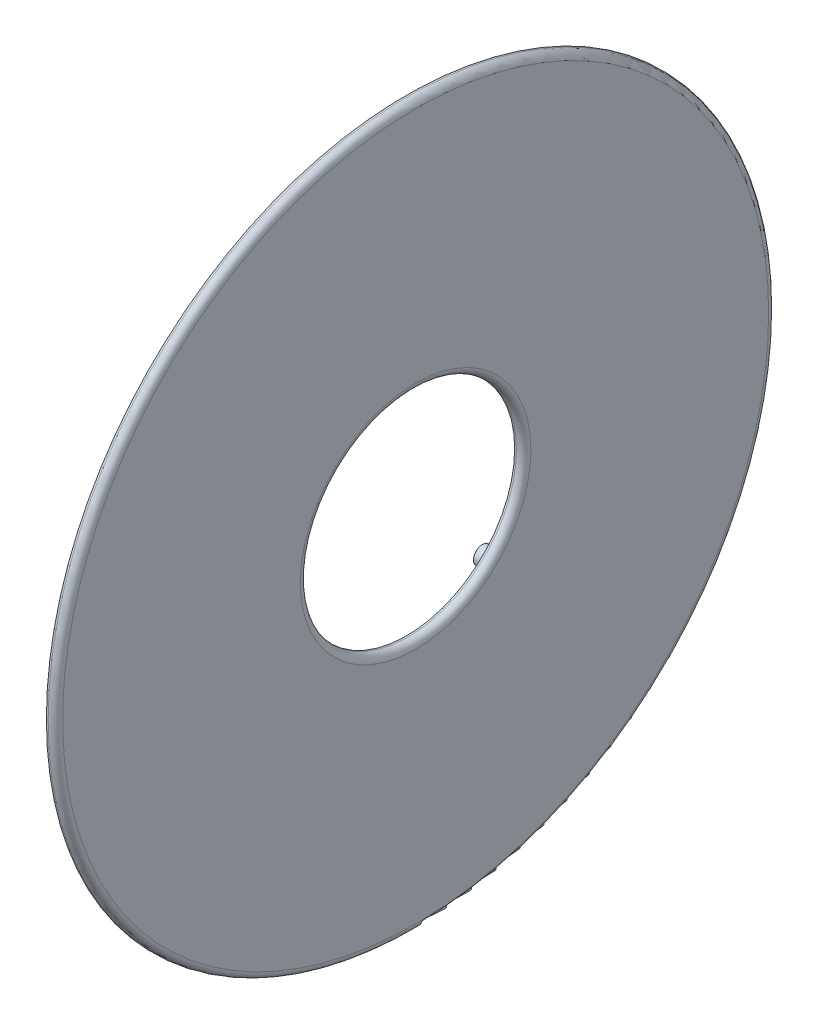
ISO-10303-21;
HEADER;
FILE_DESCRIPTION(('STEP AP214'),'2;1');
FILE_NAME('part.step','',(''),(''),'','','');
FILE_SCHEMA(('AUTOMOTIVE_DESIGN { 1 0 10303 214 1 1 1 1 }'));
ENDSEC;
DATA;
#1=APPLICATION_CONTEXT('core data for automotive mechanical design processes');
#2=APPLICATION_PROTOCOL_DEFINITION('international standard','automotive_design',2000,#1);
#3=PRODUCT_CONTEXT('',#1,'mechanical');
#4=PRODUCT('Part','Part','',(#3));
#5=PRODUCT_RELATED_PRODUCT_CATEGORY('part','',(#4));
#6=PRODUCT_DEFINITION_FORMATION('','',#4);
#7=PRODUCT_DEFINITION_CONTEXT('part definition',#1,'design');
#8=PRODUCT_DEFINITION('design','',#6,#7);
#9=PRODUCT_DEFINITION_SHAPE('','',#8);
#10=(LENGTH_UNIT() NAMED_UNIT(*) SI_UNIT(.MILLI.,.METRE.));
#11=(NAMED_UNIT(*) PLANE_ANGLE_UNIT() SI_UNIT($,.RADIAN.));
#12=(NAMED_UNIT(*) SI_UNIT($,.STERADIAN.) SOLID_ANGLE_UNIT());
#13=UNCERTAINTY_MEASURE_WITH_UNIT(LENGTH_MEASURE(1.E-05),#10,'distance_accuracy_value','');
#14=(GEOMETRIC_REPRESENTATION_CONTEXT(3) GLOBAL_UNCERTAINTY_ASSIGNED_CONTEXT((#13)) GLOBAL_UNIT_ASSIGNED_CONTEXT((#10,
#11,#12)) REPRESENTATION_CONTEXT('',''));
#15=CARTESIAN_POINT('',(0.,0.,0.));
#16=DIRECTION('',(0.,0.,1.));
#17=DIRECTION('',(1.,0.,0.));
#18=AXIS2_PLACEMENT_3D('',#15,#16,#17);
#19=CARTESIAN_POINT('',(0.,0.,0.));
#20=DIRECTION('',(1.,0.,0.));
#21=DIRECTION('',(0.,0.,-1.));
#22=AXIS2_PLACEMENT_3D('',#19,#20,#21);
#23=PLANE('',#22);
#24=CARTESIAN_POINT('',(0.,-7.63321770290865,7.63321770290874));
#25=DIRECTION('',(1.,0.,0.));
#26=DIRECTION('',(0.,0.,-1.));
#27=AXIS2_PLACEMENT_3D('',#24,#25,#26);
#28=CIRCLE('',#27,0.635000000000002);
#29=CARTESIAN_POINT('',(0.,-7.63321770290865,6.99821770290874));
#30=VERTEX_POINT('',#29);
#31=EDGE_CURVE('E40',#30,#30,#28,.F.);
#32=ORIENTED_EDGE('',*,*,#31,.F.);
#33=EDGE_LOOP('',(#32));
#34=FACE_BOUND('',#33,.T.);
#35=CARTESIAN_POINT('',(0.,7.63321770290882,-7.63321770290874));
#36=DIRECTION('',(1.,0.,0.));
#37=DIRECTION('',(0.,0.,-1.));
#38=AXIS2_PLACEMENT_3D('',#35,#36,#37);
#39=CIRCLE('',#38,0.634999999999951);
#40=CARTESIAN_POINT('',(0.,7.63321770290882,-8.26821770290869));
#41=VERTEX_POINT('',#40);
#42=EDGE_CURVE('E48',#41,#41,#39,.F.);
#43=ORIENTED_EDGE('',*,*,#42,.F.);
#44=EDGE_LOOP('',(#43));
#45=FACE_BOUND('',#44,.T.);
#46=CARTESIAN_POINT('',(0.,0.,0.));
#47=DIRECTION('',(1.,0.,0.));
#48=DIRECTION('',(0.,0.,-1.));
#49=AXIS2_PLACEMENT_3D('',#46,#47,#48);
#50=CIRCLE('',#49,25.4);
#51=CARTESIAN_POINT('',(0.,0.,-25.4));
#52=VERTEX_POINT('',#51);
#53=EDGE_CURVE('E65',#52,#52,#50,.T.);
#54=ORIENTED_EDGE('',*,*,#53,.F.);
#55=EDGE_LOOP('',(#54));
#56=FACE_BOUND('',#55,.T.);
#57=CARTESIAN_POINT('',(0.,0.,0.));
#58=DIRECTION('',(1.,0.,0.));
#59=DIRECTION('',(0.,0.,-1.));
#60=AXIS2_PLACEMENT_3D('',#57,#58,#59);
#61=CIRCLE('',#60,7.62);
#62=CARTESIAN_POINT('',(0.,0.,-7.62));
#63=VERTEX_POINT('',#62);
#64=EDGE_CURVE('E68',#63,#63,#61,.T.);
#65=ORIENTED_EDGE('',*,*,#64,.T.);
#66=EDGE_LOOP('',(#65));
#67=FACE_BOUND('',#66,.T.);
#68=CARTESIAN_POINT('',(0.,7.63321770290882,7.63321770290874));
#69=DIRECTION('',(1.,0.,0.));
#70=DIRECTION('',(0.,0.,-1.));
#71=AXIS2_PLACEMENT_3D('',#68,#69,#70);
#72=CIRCLE('',#71,0.635000000000001);
#73=CARTESIAN_POINT('',(0.,7.63321770290882,6.99821770290874));
#74=VERTEX_POINT('',#73);
#75=EDGE_CURVE('E44',#74,#74,#72,.F.);
#76=ORIENTED_EDGE('',*,*,#75,.F.);
#77=EDGE_LOOP('',(#76));
#78=FACE_BOUND('',#77,.T.);
#79=CARTESIAN_POINT('',(0.,-7.63321770290865,-7.63321770290874));
#80=DIRECTION('',(1.,0.,0.));
#81=DIRECTION('',(0.,0.,-1.));
#82=AXIS2_PLACEMENT_3D('',#79,#80,#81);
#83=CIRCLE('',#82,0.635000000000001);
#84=CARTESIAN_POINT('',(0.,-7.63321770290865,-8.26821770290874));
#85=VERTEX_POINT('',#84);
#86=EDGE_CURVE('E10',#85,#85,#83,.F.);
#87=ORIENTED_EDGE('',*,*,#86,.F.);
#88=EDGE_LOOP('',(#87));
#89=FACE_BOUND('',#88,.T.);
#90=ADVANCED_FACE('F33',(#34,#45,#56,#67,#78,#89),#23,.F.);
#91=CARTESIAN_POINT('',(0.635,0.,0.));
#92=DIRECTION('',(1.,0.,0.));
#93=DIRECTION('',(0.,0.,-1.));
#94=AXIS2_PLACEMENT_3D('',#91,#92,#93);
#95=PLANE('',#94);
#96=CARTESIAN_POINT('',(0.635,0.,0.));
#97=DIRECTION('',(1.,0.,0.));
#98=DIRECTION('',(0.,0.,-1.));
#99=AXIS2_PLACEMENT_3D('',#96,#97,#98);
#100=CIRCLE('',#99,8.128);
#101=CARTESIAN_POINT('',(0.635,0.,-8.128));
#102=VERTEX_POINT('',#101);
#103=EDGE_CURVE('E56',#102,#102,#100,.F.);
#104=ORIENTED_EDGE('',*,*,#103,.T.);
#105=EDGE_LOOP('',(#104));
#106=FACE_BOUND('',#105,.T.);
#107=CARTESIAN_POINT('',(0.635,0.,0.));
#108=DIRECTION('',(1.,0.,0.));
#109=DIRECTION('',(0.,0.,-1.));
#110=AXIS2_PLACEMENT_3D('',#107,#108,#109);
#111=CIRCLE('',#110,24.892);
#112=CARTESIAN_POINT('',(0.635,0.,-24.892));
#113=VERTEX_POINT('',#112);
#114=EDGE_CURVE('E59',#113,#113,#111,.T.);
#115=ORIENTED_EDGE('',*,*,#114,.T.);
#116=EDGE_LOOP('',(#115));
#117=FACE_BOUND('',#116,.T.);
#118=ADVANCED_FACE('F99',(#106,#117),#95,.T.);
#119=CARTESIAN_POINT('',(0.635,0.,0.));
#120=DIRECTION('',(-1.,0.,0.));
#121=DIRECTION('',(0.,0.,1.));
#122=AXIS2_PLACEMENT_3D('',#119,#120,#121);
#123=CYLINDRICAL_SURFACE('',#122,25.4);
#124=CARTESIAN_POINT('',(0.127,0.,0.));
#125=DIRECTION('',(1.,0.,0.));
#126=DIRECTION('',(0.,0.,-1.));
#127=AXIS2_PLACEMENT_3D('',#124,#125,#126);
#128=CIRCLE('',#127,25.4);
#129=CARTESIAN_POINT('',(0.127,0.,-25.4));
#130=VERTEX_POINT('',#129);
#131=EDGE_CURVE('E53',#130,#130,#128,.F.);
#132=ORIENTED_EDGE('',*,*,#131,.T.);
#133=EDGE_LOOP('',(#132));
#134=FACE_BOUND('',#133,.T.);
#135=ORIENTED_EDGE('',*,*,#53,.T.);
#136=EDGE_LOOP('',(#135));
#137=FACE_BOUND('',#136,.T.);
#138=ADVANCED_FACE('F105',(#134,#137),#123,.T.);
#139=CARTESIAN_POINT('',(0.635,0.,0.));
#140=DIRECTION('',(-1.,0.,0.));
#141=DIRECTION('',(0.,0.,1.));
#142=AXIS2_PLACEMENT_3D('',#139,#140,#141);
#143=CYLINDRICAL_SURFACE('',#142,7.62);
#144=CARTESIAN_POINT('',(0.127,0.,0.));
#145=DIRECTION('',(1.,0.,0.));
#146=DIRECTION('',(0.,0.,-1.));
#147=AXIS2_PLACEMENT_3D('',#144,#145,#146);
#148=CIRCLE('',#147,7.62);
#149=CARTESIAN_POINT('',(0.127,0.,-7.62));
#150=VERTEX_POINT('',#149);
#151=EDGE_CURVE('E62',#150,#150,#148,.T.);
#152=ORIENTED_EDGE('',*,*,#151,.T.);
#153=EDGE_LOOP('',(#152));
#154=FACE_BOUND('',#153,.T.);
#155=ORIENTED_EDGE('',*,*,#64,.F.);
#156=EDGE_LOOP('',(#155));
#157=FACE_BOUND('',#156,.T.);
#158=ADVANCED_FACE('F112',(#154,#157),#143,.F.);
#159=CARTESIAN_POINT('',(0.127,0.,0.));
#160=DIRECTION('',(1.,0.,0.));
#161=DIRECTION('',(0.,0.,-1.));
#162=AXIS2_PLACEMENT_3D('',#159,#160,#161);
#163=TOROIDAL_SURFACE('',#162,8.128,0.508);
#164=ORIENTED_EDGE('',*,*,#103,.F.);
#165=EDGE_LOOP('',(#164));
#166=FACE_BOUND('',#165,.T.);
#167=ORIENTED_EDGE('',*,*,#151,.F.);
#168=EDGE_LOOP('',(#167));
#169=FACE_BOUND('',#168,.T.);
#170=ADVANCED_FACE('F114',(#166,#169),#163,.T.);
#171=CARTESIAN_POINT('',(0.127,0.,0.));
#172=DIRECTION('',(1.,0.,0.));
#173=DIRECTION('',(0.,0.,-1.));
#174=AXIS2_PLACEMENT_3D('',#171,#172,#173);
#175=TOROIDAL_SURFACE('',#174,24.892,0.508);
#176=ORIENTED_EDGE('',*,*,#131,.F.);
#177=EDGE_LOOP('',(#176));
#178=FACE_BOUND('',#177,.T.);
#179=ORIENTED_EDGE('',*,*,#114,.F.);
#180=EDGE_LOOP('',(#179));
#181=FACE_BOUND('',#180,.T.);
#182=ADVANCED_FACE('F35',(#178,#181),#175,.T.);
#183=CARTESIAN_POINT('',(-2.286,7.63321770290882,-7.63321770290874));
#184=DIRECTION('',(1.,0.,0.));
#185=DIRECTION('',(0.,0.,-1.));
#186=AXIS2_PLACEMENT_3D('',#183,#184,#185);
#187=CYLINDRICAL_SURFACE('',#186,0.634999999999951);
#188=CARTESIAN_POINT('',(-2.286,7.63321770290882,-7.63321770290874));
#189=DIRECTION('',(-1.,0.,0.));
#190=DIRECTION('',(0.,0.,1.));
#191=AXIS2_PLACEMENT_3D('',#188,#189,#190);
#192=CIRCLE('',#191,0.634999999999951);
#193=CARTESIAN_POINT('',(-2.286,7.63321770290882,-6.99821770290879));
#194=VERTEX_POINT('',#193);
#195=EDGE_CURVE('E71',#194,#194,#192,.T.);
#196=ORIENTED_EDGE('',*,*,#195,.F.);
#197=EDGE_LOOP('',(#196));
#198=FACE_BOUND('',#197,.T.);
#199=ORIENTED_EDGE('',*,*,#42,.T.);
#200=EDGE_LOOP('',(#199));
#201=FACE_BOUND('',#200,.T.);
#202=ADVANCED_FACE('F121',(#198,#201),#187,.T.);
#203=CARTESIAN_POINT('',(-2.286,7.63321770290882,-7.63321770290874));
#204=DIRECTION('',(-1.,0.,0.));
#205=DIRECTION('',(0.,0.,1.));
#206=AXIS2_PLACEMENT_3D('',#203,#204,#205);
#207=PLANE('',#206);
#208=ORIENTED_EDGE('',*,*,#195,.T.);
#209=EDGE_LOOP('',(#208));
#210=FACE_BOUND('',#209,.T.);
#211=ADVANCED_FACE('F137',(#210),#207,.T.);
#212=CARTESIAN_POINT('',(-2.286,7.63321770290882,7.63321770290874));
#213=DIRECTION('',(1.,0.,0.));
#214=DIRECTION('',(0.,0.,-1.));
#215=AXIS2_PLACEMENT_3D('',#212,#213,#214);
#216=CYLINDRICAL_SURFACE('',#215,0.635000000000001);
#217=CARTESIAN_POINT('',(-2.286,7.63321770290882,7.63321770290874));
#218=DIRECTION('',(-1.,0.,0.));
#219=DIRECTION('',(0.,0.,1.));
#220=AXIS2_PLACEMENT_3D('',#217,#218,#219);
#221=CIRCLE('',#220,0.635000000000001);
#222=CARTESIAN_POINT('',(-2.286,7.63321770290882,8.26821770290874));
#223=VERTEX_POINT('',#222);
#224=EDGE_CURVE('E74',#223,#223,#221,.T.);
#225=ORIENTED_EDGE('',*,*,#224,.F.);
#226=EDGE_LOOP('',(#225));
#227=FACE_BOUND('',#226,.T.);
#228=ORIENTED_EDGE('',*,*,#75,.T.);
#229=EDGE_LOOP('',(#228));
#230=FACE_BOUND('',#229,.T.);
#231=ADVANCED_FACE('F134',(#227,#230),#216,.T.);
#232=CARTESIAN_POINT('',(-2.286,7.63321770290882,7.63321770290874));
#233=DIRECTION('',(-1.,0.,0.));
#234=DIRECTION('',(0.,0.,1.));
#235=AXIS2_PLACEMENT_3D('',#232,#233,#234);
#236=PLANE('',#235);
#237=ORIENTED_EDGE('',*,*,#224,.T.);
#238=EDGE_LOOP('',(#237));
#239=FACE_BOUND('',#238,.T.);
#240=ADVANCED_FACE('F136',(#239),#236,.T.);
#241=CARTESIAN_POINT('',(-2.286,-7.63321770290865,7.63321770290874));
#242=DIRECTION('',(1.,0.,0.));
#243=DIRECTION('',(0.,0.,-1.));
#244=AXIS2_PLACEMENT_3D('',#241,#242,#243);
#245=CYLINDRICAL_SURFACE('',#244,0.635000000000002);
#246=CARTESIAN_POINT('',(-2.286,-7.63321770290865,7.63321770290874));
#247=DIRECTION('',(-1.,0.,0.));
#248=DIRECTION('',(0.,0.,1.));
#249=AXIS2_PLACEMENT_3D('',#246,#247,#248);
#250=CIRCLE('',#249,0.635000000000002);
#251=CARTESIAN_POINT('',(-2.286,-7.63321770290865,8.26821770290874));
#252=VERTEX_POINT('',#251);
#253=EDGE_CURVE('E77',#252,#252,#250,.T.);
#254=ORIENTED_EDGE('',*,*,#253,.F.);
#255=EDGE_LOOP('',(#254));
#256=FACE_BOUND('',#255,.T.);
#257=ORIENTED_EDGE('',*,*,#31,.T.);
#258=EDGE_LOOP('',(#257));
#259=FACE_BOUND('',#258,.T.);
#260=ADVANCED_FACE('F95',(#256,#259),#245,.T.);
#261=CARTESIAN_POINT('',(-2.286,-7.63321770290865,7.63321770290874));
#262=DIRECTION('',(-1.,0.,0.));
#263=DIRECTION('',(0.,0.,1.));
#264=AXIS2_PLACEMENT_3D('',#261,#262,#263);
#265=PLANE('',#264);
#266=ORIENTED_EDGE('',*,*,#253,.T.);
#267=EDGE_LOOP('',(#266));
#268=FACE_BOUND('',#267,.T.);
#269=ADVANCED_FACE('F88',(#268),#265,.T.);
#270=CARTESIAN_POINT('',(-2.286,-7.63321770290865,-7.63321770290874));
#271=DIRECTION('',(1.,0.,0.));
#272=DIRECTION('',(0.,0.,-1.));
#273=AXIS2_PLACEMENT_3D('',#270,#271,#272);
#274=CYLINDRICAL_SURFACE('',#273,0.635000000000001);
#275=CARTESIAN_POINT('',(-2.286,-7.63321770290865,-7.63321770290874));
#276=DIRECTION('',(-1.,0.,0.));
#277=DIRECTION('',(0.,0.,1.));
#278=AXIS2_PLACEMENT_3D('',#275,#276,#277);
#279=CIRCLE('',#278,0.635000000000001);
#280=CARTESIAN_POINT('',(-2.286,-7.63321770290865,-6.99821770290874));
#281=VERTEX_POINT('',#280);
#282=EDGE_CURVE('E80',#281,#281,#279,.T.);
#283=ORIENTED_EDGE('',*,*,#282,.F.);
#284=EDGE_LOOP('',(#283));
#285=FACE_BOUND('',#284,.T.);
#286=ORIENTED_EDGE('',*,*,#86,.T.);
#287=EDGE_LOOP('',(#286));
#288=FACE_BOUND('',#287,.T.);
#289=ADVANCED_FACE('F86',(#285,#288),#274,.T.);
#290=CARTESIAN_POINT('',(-2.286,-7.63321770290865,-7.63321770290874));
#291=DIRECTION('',(-1.,0.,0.));
#292=DIRECTION('',(0.,0.,1.));
#293=AXIS2_PLACEMENT_3D('',#290,#291,#292);
#294=PLANE('',#293);
#295=ORIENTED_EDGE('',*,*,#282,.T.);
#296=EDGE_LOOP('',(#295));
#297=FACE_BOUND('',#296,.T.);
#298=ADVANCED_FACE('F84',(#297),#294,.T.);
#299=CLOSED_SHELL('',(#90,#118,#138,#158,#170,#182,#202,#211,#231,#240,#260,#269,#289,#298));
#300=MANIFOLD_SOLID_BREP('B2',#299);
#301=ADVANCED_BREP_SHAPE_REPRESENTATION('',(#18,#300),#14);
#302=SHAPE_DEFINITION_REPRESENTATION(#9,#301);
ENDSEC;
END-ISO-10303-21;
